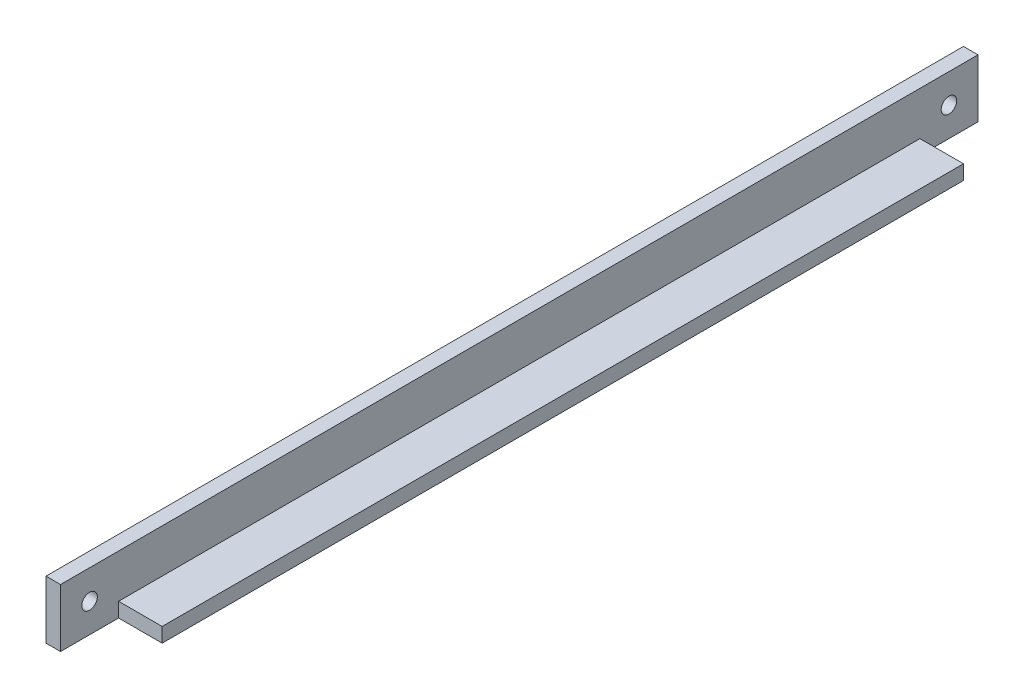
ISO-10303-21;
HEADER;
FILE_DESCRIPTION(('STEP AP214'),'2;1');
FILE_NAME('part.step','',(''),(''),'','','');
FILE_SCHEMA(('AUTOMOTIVE_DESIGN { 1 0 10303 214 1 1 1 1 }'));
ENDSEC;
DATA;
#1=APPLICATION_CONTEXT('core data for automotive mechanical design processes');
#2=APPLICATION_PROTOCOL_DEFINITION('international standard','automotive_design',2000,#1);
#3=PRODUCT_CONTEXT('',#1,'mechanical');
#4=PRODUCT('Part','Part','',(#3));
#5=PRODUCT_RELATED_PRODUCT_CATEGORY('part','',(#4));
#6=PRODUCT_DEFINITION_FORMATION('','',#4);
#7=PRODUCT_DEFINITION_CONTEXT('part definition',#1,'design');
#8=PRODUCT_DEFINITION('design','',#6,#7);
#9=PRODUCT_DEFINITION_SHAPE('','',#8);
#10=(LENGTH_UNIT() NAMED_UNIT(*) SI_UNIT(.MILLI.,.METRE.));
#11=(NAMED_UNIT(*) PLANE_ANGLE_UNIT() SI_UNIT($,.RADIAN.));
#12=(NAMED_UNIT(*) SI_UNIT($,.STERADIAN.) SOLID_ANGLE_UNIT());
#13=UNCERTAINTY_MEASURE_WITH_UNIT(LENGTH_MEASURE(1.E-05),#10,'distance_accuracy_value','');
#14=(GEOMETRIC_REPRESENTATION_CONTEXT(3) GLOBAL_UNCERTAINTY_ASSIGNED_CONTEXT((#13)) GLOBAL_UNIT_ASSIGNED_CONTEXT((#10,
#11,#12)) REPRESENTATION_CONTEXT('',''));
#15=CARTESIAN_POINT('',(0.,0.,0.));
#16=DIRECTION('',(0.,0.,1.));
#17=DIRECTION('',(1.,0.,0.));
#18=AXIS2_PLACEMENT_3D('',#15,#16,#17);
#19=CARTESIAN_POINT('',(12.7,0.,200.66));
#20=DIRECTION('',(0.,1.,0.));
#21=DIRECTION('',(-1.,0.,0.));
#22=AXIS2_PLACEMENT_3D('',#19,#20,#21);
#23=PLANE('',#22);
#24=DIRECTION('',(0.,0.,1.));
#25=VECTOR('',#24,1.);
#26=CARTESIAN_POINT('',(3.175,0.,0.));
#27=LINE('',#26,#25);
#28=CARTESIAN_POINT('',(3.175,0.,0.));
#29=VERTEX_POINT('',#28);
#30=CARTESIAN_POINT('',(3.175,0.,12.7));
#31=VERTEX_POINT('',#30);
#32=EDGE_CURVE('E113',#29,#31,#27,.T.);
#33=ORIENTED_EDGE('',*,*,#32,.T.);
#34=DIRECTION('',(1.,0.,0.));
#35=VECTOR('',#34,1.);
#36=CARTESIAN_POINT('',(12.7,0.,12.7));
#37=LINE('',#36,#35);
#38=CARTESIAN_POINT('',(12.7,0.,12.7));
#39=VERTEX_POINT('',#38);
#40=EDGE_CURVE('E120',#31,#39,#37,.T.);
#41=ORIENTED_EDGE('',*,*,#40,.T.);
#42=DIRECTION('',(0.,0.,-1.));
#43=VECTOR('',#42,1.);
#44=CARTESIAN_POINT('',(12.7,0.,200.66));
#45=LINE('',#44,#43);
#46=CARTESIAN_POINT('',(12.7,0.,187.96));
#47=VERTEX_POINT('',#46);
#48=EDGE_CURVE('E11',#47,#39,#45,.T.);
#49=ORIENTED_EDGE('',*,*,#48,.F.);
#50=DIRECTION('',(-1.,0.,0.));
#51=VECTOR('',#50,1.);
#52=CARTESIAN_POINT('',(3.175,0.,187.96));
#53=LINE('',#52,#51);
#54=CARTESIAN_POINT('',(3.175,0.,187.96));
#55=VERTEX_POINT('',#54);
#56=EDGE_CURVE('E141',#47,#55,#53,.T.);
#57=ORIENTED_EDGE('',*,*,#56,.T.);
#58=DIRECTION('',(0.,0.,1.));
#59=VECTOR('',#58,1.);
#60=CARTESIAN_POINT('',(3.175,0.,200.66));
#61=LINE('',#60,#59);
#62=CARTESIAN_POINT('',(3.175,0.,200.66));
#63=VERTEX_POINT('',#62);
#64=EDGE_CURVE('E138',#55,#63,#61,.T.);
#65=ORIENTED_EDGE('',*,*,#64,.T.);
#66=DIRECTION('',(1.,0.,0.));
#67=VECTOR('',#66,1.);
#68=CARTESIAN_POINT('',(12.7,0.,200.66));
#69=LINE('',#68,#67);
#70=CARTESIAN_POINT('',(0.,0.,200.66));
#71=VERTEX_POINT('',#70);
#72=EDGE_CURVE('E151',#71,#63,#69,.T.);
#73=ORIENTED_EDGE('',*,*,#72,.F.);
#74=DIRECTION('',(0.,0.,-1.));
#75=VECTOR('',#74,1.);
#76=CARTESIAN_POINT('',(0.,0.,200.66));
#77=LINE('',#76,#75);
#78=CARTESIAN_POINT('',(0.,0.,0.));
#79=VERTEX_POINT('',#78);
#80=EDGE_CURVE('E157',#71,#79,#77,.T.);
#81=ORIENTED_EDGE('',*,*,#80,.T.);
#82=DIRECTION('',(1.,0.,0.));
#83=VECTOR('',#82,1.);
#84=CARTESIAN_POINT('',(12.7,0.,0.));
#85=LINE('',#84,#83);
#86=EDGE_CURVE('E128',#79,#29,#85,.T.);
#87=ORIENTED_EDGE('',*,*,#86,.T.);
#88=EDGE_LOOP('',(#33,#41,#49,#57,#65,#73,#81,#87));
#89=FACE_BOUND('',#88,.T.);
#90=ADVANCED_FACE('F35',(#89),#23,.F.);
#91=CARTESIAN_POINT('',(12.7,3.175,200.66));
#92=DIRECTION('',(-1.,0.,0.));
#93=DIRECTION('',(0.,0.,1.));
#94=AXIS2_PLACEMENT_3D('',#91,#92,#93);
#95=PLANE('',#94);
#96=ORIENTED_EDGE('',*,*,#48,.T.);
#97=DIRECTION('',(0.,1.,0.));
#98=VECTOR('',#97,1.);
#99=CARTESIAN_POINT('',(12.7,0.,12.7));
#100=LINE('',#99,#98);
#101=CARTESIAN_POINT('',(12.7,3.175,12.7));
#102=VERTEX_POINT('',#101);
#103=EDGE_CURVE('E119',#39,#102,#100,.T.);
#104=ORIENTED_EDGE('',*,*,#103,.T.);
#105=DIRECTION('',(0.,0.,-1.));
#106=VECTOR('',#105,1.);
#107=CARTESIAN_POINT('',(12.7,3.175,200.66));
#108=LINE('',#107,#106);
#109=CARTESIAN_POINT('',(12.7,3.175,187.96));
#110=VERTEX_POINT('',#109);
#111=EDGE_CURVE('E43',#110,#102,#108,.T.);
#112=ORIENTED_EDGE('',*,*,#111,.F.);
#113=DIRECTION('',(0.,1.,0.));
#114=VECTOR('',#113,1.);
#115=CARTESIAN_POINT('',(12.7,0.,187.96));
#116=LINE('',#115,#114);
#117=EDGE_CURVE('E145',#47,#110,#116,.T.);
#118=ORIENTED_EDGE('',*,*,#117,.F.);
#119=EDGE_LOOP('',(#96,#104,#112,#118));
#120=FACE_BOUND('',#119,.T.);
#121=ADVANCED_FACE('F205',(#120),#95,.F.);
#122=CARTESIAN_POINT('',(3.175,3.175,200.66));
#123=DIRECTION('',(0.,-1.,0.));
#124=DIRECTION('',(0.,0.,-1.));
#125=AXIS2_PLACEMENT_3D('',#122,#123,#124);
#126=PLANE('',#125);
#127=ORIENTED_EDGE('',*,*,#111,.T.);
#128=DIRECTION('',(1.,0.,0.));
#129=VECTOR('',#128,1.);
#130=CARTESIAN_POINT('',(12.7,3.175,12.7));
#131=LINE('',#130,#129);
#132=CARTESIAN_POINT('',(3.175,3.175,12.7));
#133=VERTEX_POINT('',#132);
#134=EDGE_CURVE('E129',#133,#102,#131,.T.);
#135=ORIENTED_EDGE('',*,*,#134,.F.);
#136=DIRECTION('',(0.,0.,-1.));
#137=VECTOR('',#136,1.);
#138=CARTESIAN_POINT('',(3.175,3.175,200.66));
#139=LINE('',#138,#137);
#140=CARTESIAN_POINT('',(3.175,3.175,187.96));
#141=VERTEX_POINT('',#140);
#142=EDGE_CURVE('E116',#141,#133,#139,.T.);
#143=ORIENTED_EDGE('',*,*,#142,.F.);
#144=DIRECTION('',(-1.,0.,0.));
#145=VECTOR('',#144,1.);
#146=CARTESIAN_POINT('',(3.175,3.175,187.96));
#147=LINE('',#146,#145);
#148=EDGE_CURVE('E142',#110,#141,#147,.T.);
#149=ORIENTED_EDGE('',*,*,#148,.F.);
#150=EDGE_LOOP('',(#127,#135,#143,#149));
#151=FACE_BOUND('',#150,.T.);
#152=ADVANCED_FACE('F209',(#151),#126,.F.);
#153=CARTESIAN_POINT('',(3.175,12.7,200.66));
#154=DIRECTION('',(-1.,0.,0.));
#155=DIRECTION('',(0.,-1.,0.));
#156=AXIS2_PLACEMENT_3D('',#153,#154,#155);
#157=PLANE('',#156);
#158=CARTESIAN_POINT('',(3.175,6.35,6.34999999999999));
#159=DIRECTION('',(-1.,0.,0.));
#160=DIRECTION('',(0.,-1.,0.));
#161=AXIS2_PLACEMENT_3D('',#158,#159,#160);
#162=CIRCLE('',#161,1.69999999999999);
#163=CARTESIAN_POINT('',(3.175,4.65000000000001,6.34999999999999));
#164=VERTEX_POINT('',#163);
#165=EDGE_CURVE('E38',#164,#164,#162,.T.);
#166=ORIENTED_EDGE('',*,*,#165,.T.);
#167=EDGE_LOOP('',(#166));
#168=FACE_BOUND('',#167,.T.);
#169=CARTESIAN_POINT('',(3.175,6.35,194.31));
#170=DIRECTION('',(-1.,0.,0.));
#171=DIRECTION('',(0.,-1.,0.));
#172=AXIS2_PLACEMENT_3D('',#169,#170,#171);
#173=CIRCLE('',#172,1.69999999999999);
#174=CARTESIAN_POINT('',(3.175,4.65000000000001,194.31));
#175=VERTEX_POINT('',#174);
#176=EDGE_CURVE('E148',#175,#175,#173,.T.);
#177=ORIENTED_EDGE('',*,*,#176,.T.);
#178=EDGE_LOOP('',(#177));
#179=FACE_BOUND('',#178,.T.);
#180=DIRECTION('',(0.,1.,0.));
#181=VECTOR('',#180,1.);
#182=CARTESIAN_POINT('',(3.175,12.7,0.));
#183=LINE('',#182,#181);
#184=CARTESIAN_POINT('',(3.175,12.7,0.));
#185=VERTEX_POINT('',#184);
#186=EDGE_CURVE('E51',#29,#185,#183,.T.);
#187=ORIENTED_EDGE('',*,*,#186,.T.);
#188=DIRECTION('',(0.,0.,-1.));
#189=VECTOR('',#188,1.);
#190=CARTESIAN_POINT('',(3.175,12.7,200.66));
#191=LINE('',#190,#189);
#192=CARTESIAN_POINT('',(3.175,12.7,200.66));
#193=VERTEX_POINT('',#192);
#194=EDGE_CURVE('E166',#193,#185,#191,.T.);
#195=ORIENTED_EDGE('',*,*,#194,.F.);
#196=DIRECTION('',(0.,1.,0.));
#197=VECTOR('',#196,1.);
#198=CARTESIAN_POINT('',(3.175,12.7,200.66));
#199=LINE('',#198,#197);
#200=EDGE_CURVE('E80',#63,#193,#199,.T.);
#201=ORIENTED_EDGE('',*,*,#200,.F.);
#202=ORIENTED_EDGE('',*,*,#64,.F.);
#203=DIRECTION('',(0.,1.,0.));
#204=VECTOR('',#203,1.);
#205=CARTESIAN_POINT('',(3.175,0.,187.96));
#206=LINE('',#205,#204);
#207=EDGE_CURVE('E131',#55,#141,#206,.T.);
#208=ORIENTED_EDGE('',*,*,#207,.T.);
#209=ORIENTED_EDGE('',*,*,#142,.T.);
#210=DIRECTION('',(0.,1.,0.));
#211=VECTOR('',#210,1.);
#212=CARTESIAN_POINT('',(3.175,0.,12.7));
#213=LINE('',#212,#211);
#214=EDGE_CURVE('E109',#31,#133,#213,.T.);
#215=ORIENTED_EDGE('',*,*,#214,.F.);
#216=ORIENTED_EDGE('',*,*,#32,.F.);
#217=EDGE_LOOP('',(#187,#195,#201,#202,#208,#209,#215,#216));
#218=FACE_BOUND('',#217,.T.);
#219=ADVANCED_FACE('F111',(#168,#179,#218),#157,.F.);
#220=CARTESIAN_POINT('',(0.,12.7,200.66));
#221=DIRECTION('',(0.,-1.,0.));
#222=DIRECTION('',(0.,0.,-1.));
#223=AXIS2_PLACEMENT_3D('',#220,#221,#222);
#224=PLANE('',#223);
#225=DIRECTION('',(-1.,0.,0.));
#226=VECTOR('',#225,1.);
#227=CARTESIAN_POINT('',(0.,12.7,0.));
#228=LINE('',#227,#226);
#229=CARTESIAN_POINT('',(0.,12.7,0.));
#230=VERTEX_POINT('',#229);
#231=EDGE_CURVE('E160',#185,#230,#228,.T.);
#232=ORIENTED_EDGE('',*,*,#231,.T.);
#233=DIRECTION('',(0.,0.,-1.));
#234=VECTOR('',#233,1.);
#235=CARTESIAN_POINT('',(0.,12.7,200.66));
#236=LINE('',#235,#234);
#237=CARTESIAN_POINT('',(0.,12.7,200.66));
#238=VERTEX_POINT('',#237);
#239=EDGE_CURVE('E164',#238,#230,#236,.T.);
#240=ORIENTED_EDGE('',*,*,#239,.F.);
#241=DIRECTION('',(-1.,0.,0.));
#242=VECTOR('',#241,1.);
#243=CARTESIAN_POINT('',(0.,12.7,200.66));
#244=LINE('',#243,#242);
#245=EDGE_CURVE('E154',#193,#238,#244,.T.);
#246=ORIENTED_EDGE('',*,*,#245,.F.);
#247=ORIENTED_EDGE('',*,*,#194,.T.);
#248=EDGE_LOOP('',(#232,#240,#246,#247));
#249=FACE_BOUND('',#248,.T.);
#250=ADVANCED_FACE('F191',(#249),#224,.F.);
#251=CARTESIAN_POINT('',(0.,0.,200.66));
#252=DIRECTION('',(1.,0.,0.));
#253=DIRECTION('',(0.,0.,-1.));
#254=AXIS2_PLACEMENT_3D('',#251,#252,#253);
#255=PLANE('',#254);
#256=CARTESIAN_POINT('',(0.,6.35,6.34999999999999));
#257=DIRECTION('',(-1.,0.,0.));
#258=DIRECTION('',(0.,0.,1.));
#259=AXIS2_PLACEMENT_3D('',#256,#257,#258);
#260=CIRCLE('',#259,1.69999999999999);
#261=CARTESIAN_POINT('',(0.,6.35,8.04999999999998));
#262=VERTEX_POINT('',#261);
#263=EDGE_CURVE('E178',#262,#262,#260,.T.);
#264=ORIENTED_EDGE('',*,*,#263,.F.);
#265=EDGE_LOOP('',(#264));
#266=FACE_BOUND('',#265,.T.);
#267=CARTESIAN_POINT('',(0.,6.35,194.31));
#268=DIRECTION('',(-1.,0.,0.));
#269=DIRECTION('',(0.,0.,1.));
#270=AXIS2_PLACEMENT_3D('',#267,#268,#269);
#271=CIRCLE('',#270,1.69999999999999);
#272=CARTESIAN_POINT('',(0.,6.35,196.01));
#273=VERTEX_POINT('',#272);
#274=EDGE_CURVE('E134',#273,#273,#271,.T.);
#275=ORIENTED_EDGE('',*,*,#274,.F.);
#276=EDGE_LOOP('',(#275));
#277=FACE_BOUND('',#276,.T.);
#278=DIRECTION('',(0.,-1.,0.));
#279=VECTOR('',#278,1.);
#280=CARTESIAN_POINT('',(0.,0.,0.));
#281=LINE('',#280,#279);
#282=EDGE_CURVE('E76',#230,#79,#281,.T.);
#283=ORIENTED_EDGE('',*,*,#282,.T.);
#284=ORIENTED_EDGE('',*,*,#80,.F.);
#285=DIRECTION('',(0.,-1.,0.));
#286=VECTOR('',#285,1.);
#287=CARTESIAN_POINT('',(0.,0.,200.66));
#288=LINE('',#287,#286);
#289=EDGE_CURVE('E60',#238,#71,#288,.T.);
#290=ORIENTED_EDGE('',*,*,#289,.F.);
#291=ORIENTED_EDGE('',*,*,#239,.T.);
#292=EDGE_LOOP('',(#283,#284,#290,#291));
#293=FACE_BOUND('',#292,.T.);
#294=ADVANCED_FACE('F187',(#266,#277,#293),#255,.F.);
#295=CARTESIAN_POINT('',(0.,0.,200.66));
#296=DIRECTION('',(0.,0.,-1.));
#297=DIRECTION('',(-1.,0.,0.));
#298=AXIS2_PLACEMENT_3D('',#295,#296,#297);
#299=PLANE('',#298);
#300=ORIENTED_EDGE('',*,*,#72,.T.);
#301=ORIENTED_EDGE('',*,*,#200,.T.);
#302=ORIENTED_EDGE('',*,*,#245,.T.);
#303=ORIENTED_EDGE('',*,*,#289,.T.);
#304=EDGE_LOOP('',(#300,#301,#302,#303));
#305=FACE_BOUND('',#304,.T.);
#306=ADVANCED_FACE('F190',(#305),#299,.F.);
#307=CARTESIAN_POINT('',(0.,0.,0.));
#308=DIRECTION('',(0.,0.,-1.));
#309=DIRECTION('',(-1.,0.,0.));
#310=AXIS2_PLACEMENT_3D('',#307,#308,#309);
#311=PLANE('',#310);
#312=ORIENTED_EDGE('',*,*,#186,.F.);
#313=ORIENTED_EDGE('',*,*,#86,.F.);
#314=ORIENTED_EDGE('',*,*,#282,.F.);
#315=ORIENTED_EDGE('',*,*,#231,.F.);
#316=EDGE_LOOP('',(#312,#313,#314,#315));
#317=FACE_BOUND('',#316,.T.);
#318=ADVANCED_FACE('F198',(#317),#311,.T.);
#319=CARTESIAN_POINT('',(12.7,0.,12.7));
#320=DIRECTION('',(0.,0.,1.));
#321=DIRECTION('',(1.,0.,0.));
#322=AXIS2_PLACEMENT_3D('',#319,#320,#321);
#323=PLANE('',#322);
#324=ORIENTED_EDGE('',*,*,#134,.T.);
#325=ORIENTED_EDGE('',*,*,#103,.F.);
#326=ORIENTED_EDGE('',*,*,#40,.F.);
#327=ORIENTED_EDGE('',*,*,#214,.T.);
#328=EDGE_LOOP('',(#324,#325,#326,#327));
#329=FACE_BOUND('',#328,.T.);
#330=ADVANCED_FACE('F123',(#329),#323,.F.);
#331=CARTESIAN_POINT('',(3.175,0.,187.96));
#332=DIRECTION('',(0.,0.,-1.));
#333=DIRECTION('',(-1.,0.,0.));
#334=AXIS2_PLACEMENT_3D('',#331,#332,#333);
#335=PLANE('',#334);
#336=ORIENTED_EDGE('',*,*,#148,.T.);
#337=ORIENTED_EDGE('',*,*,#207,.F.);
#338=ORIENTED_EDGE('',*,*,#56,.F.);
#339=ORIENTED_EDGE('',*,*,#117,.T.);
#340=EDGE_LOOP('',(#336,#337,#338,#339));
#341=FACE_BOUND('',#340,.T.);
#342=ADVANCED_FACE('F222',(#341),#335,.F.);
#343=CARTESIAN_POINT('',(0.,6.35,194.31));
#344=DIRECTION('',(-1.,0.,0.));
#345=DIRECTION('',(0.,0.,1.));
#346=AXIS2_PLACEMENT_3D('',#343,#344,#345);
#347=CYLINDRICAL_SURFACE('',#346,1.69999999999999);
#348=ORIENTED_EDGE('',*,*,#274,.T.);
#349=EDGE_LOOP('',(#348));
#350=FACE_BOUND('',#349,.T.);
#351=ORIENTED_EDGE('',*,*,#176,.F.);
#352=EDGE_LOOP('',(#351));
#353=FACE_BOUND('',#352,.T.);
#354=ADVANCED_FACE('F227',(#350,#353),#347,.F.);
#355=CARTESIAN_POINT('',(0.,6.35,6.34999999999999));
#356=DIRECTION('',(-1.,0.,0.));
#357=DIRECTION('',(0.,0.,1.));
#358=AXIS2_PLACEMENT_3D('',#355,#356,#357);
#359=CYLINDRICAL_SURFACE('',#358,1.69999999999999);
#360=ORIENTED_EDGE('',*,*,#263,.T.);
#361=EDGE_LOOP('',(#360));
#362=FACE_BOUND('',#361,.T.);
#363=ORIENTED_EDGE('',*,*,#165,.F.);
#364=EDGE_LOOP('',(#363));
#365=FACE_BOUND('',#364,.T.);
#366=ADVANCED_FACE('F184',(#362,#365),#359,.F.);
#367=CLOSED_SHELL('',(#90,#121,#152,#219,#250,#294,#306,#318,#330,#342,#354,#366));
#368=MANIFOLD_SOLID_BREP('B2',#367);
#369=ADVANCED_BREP_SHAPE_REPRESENTATION('',(#18,#368),#14);
#370=SHAPE_DEFINITION_REPRESENTATION(#9,#369);
ENDSEC;
END-ISO-10303-21;
